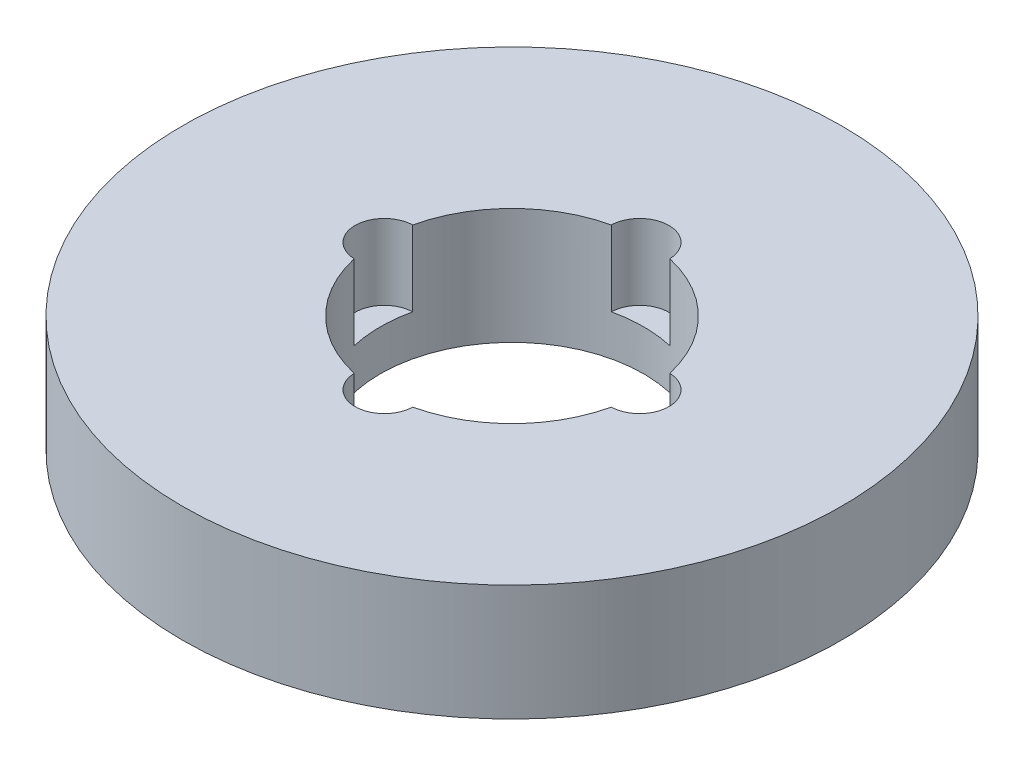
ISO-10303-21;
HEADER;
FILE_DESCRIPTION(('STEP AP214'),'2;1');
FILE_NAME('part.step','',(''),(''),'','','');
FILE_SCHEMA(('AUTOMOTIVE_DESIGN { 1 0 10303 214 1 1 1 1 }'));
ENDSEC;
DATA;
#1=APPLICATION_CONTEXT('core data for automotive mechanical design processes');
#2=APPLICATION_PROTOCOL_DEFINITION('international standard','automotive_design',2000,#1);
#3=PRODUCT_CONTEXT('',#1,'mechanical');
#4=PRODUCT('Part','Part','',(#3));
#5=PRODUCT_RELATED_PRODUCT_CATEGORY('part','',(#4));
#6=PRODUCT_DEFINITION_FORMATION('','',#4);
#7=PRODUCT_DEFINITION_CONTEXT('part definition',#1,'design');
#8=PRODUCT_DEFINITION('design','',#6,#7);
#9=PRODUCT_DEFINITION_SHAPE('','',#8);
#10=(LENGTH_UNIT() NAMED_UNIT(*) SI_UNIT(.MILLI.,.METRE.));
#11=(NAMED_UNIT(*) PLANE_ANGLE_UNIT() SI_UNIT($,.RADIAN.));
#12=(NAMED_UNIT(*) SI_UNIT($,.STERADIAN.) SOLID_ANGLE_UNIT());
#13=UNCERTAINTY_MEASURE_WITH_UNIT(LENGTH_MEASURE(1.E-05),#10,'distance_accuracy_value','');
#14=(GEOMETRIC_REPRESENTATION_CONTEXT(3) GLOBAL_UNCERTAINTY_ASSIGNED_CONTEXT((#13)) GLOBAL_UNIT_ASSIGNED_CONTEXT((#10,
#11,#12)) REPRESENTATION_CONTEXT('',''));
#15=CARTESIAN_POINT('',(0.,0.,0.));
#16=DIRECTION('',(0.,0.,1.));
#17=DIRECTION('',(1.,0.,0.));
#18=AXIS2_PLACEMENT_3D('',#15,#16,#17);
#19=CARTESIAN_POINT('',(0.,22.,0.));
#20=DIRECTION('',(0.,-1.,0.));
#21=DIRECTION('',(0.,0.,-1.));
#22=AXIS2_PLACEMENT_3D('',#19,#20,#21);
#23=CYLINDRICAL_SURFACE('',#22,62.5);
#24=CARTESIAN_POINT('',(0.,22.,0.));
#25=DIRECTION('',(0.,1.,0.));
#26=DIRECTION('',(0.,0.,1.));
#27=AXIS2_PLACEMENT_3D('',#24,#25,#26);
#28=CIRCLE('',#27,62.5);
#29=CARTESIAN_POINT('',(0.,22.,62.5));
#30=VERTEX_POINT('',#29);
#31=EDGE_CURVE('E148',#30,#30,#28,.T.);
#32=ORIENTED_EDGE('',*,*,#31,.F.);
#33=EDGE_LOOP('',(#32));
#34=FACE_BOUND('',#33,.T.);
#35=CARTESIAN_POINT('',(0.,0.,0.));
#36=DIRECTION('',(0.,1.,0.));
#37=DIRECTION('',(0.,0.,1.));
#38=AXIS2_PLACEMENT_3D('',#35,#36,#37);
#39=CIRCLE('',#38,62.5);
#40=CARTESIAN_POINT('',(0.,0.,62.5));
#41=VERTEX_POINT('',#40);
#42=EDGE_CURVE('E139',#41,#41,#39,.T.);
#43=ORIENTED_EDGE('',*,*,#42,.T.);
#44=EDGE_LOOP('',(#43));
#45=FACE_BOUND('',#44,.T.);
#46=ADVANCED_FACE('F39',(#34,#45),#23,.T.);
#47=CARTESIAN_POINT('',(0.,22.,0.));
#48=DIRECTION('',(0.,1.,0.));
#49=DIRECTION('',(0.,0.,1.));
#50=AXIS2_PLACEMENT_3D('',#47,#48,#49);
#51=PLANE('',#50);
#52=CARTESIAN_POINT('',(0.,22.,24.2118556712365));
#53=DIRECTION('',(0.,1.,0.));
#54=DIRECTION('',(1.,0.,0.));
#55=AXIS2_PLACEMENT_3D('',#52,#53,#54);
#56=CIRCLE('',#55,5.55031372699071);
#57=CARTESIAN_POINT('',(-5.54786666675236,22.,24.3766522608815));
#58=VERTEX_POINT('',#57);
#59=CARTESIAN_POINT('',(5.54786666675253,22.,24.3766522608814));
#60=VERTEX_POINT('',#59);
#61=EDGE_CURVE('E175',#58,#60,#56,.T.);
#62=ORIENTED_EDGE('',*,*,#61,.F.);
#63=CARTESIAN_POINT('',(0.,22.,0.));
#64=DIRECTION('',(0.,1.,0.));
#65=DIRECTION('',(0.,0.,1.));
#66=AXIS2_PLACEMENT_3D('',#63,#64,#65);
#67=CIRCLE('',#66,25.);
#68=CARTESIAN_POINT('',(-24.3766522608815,22.,5.54786666675245));
#69=VERTEX_POINT('',#68);
#70=EDGE_CURVE('E134',#69,#58,#67,.T.);
#71=ORIENTED_EDGE('',*,*,#70,.F.);
#72=CARTESIAN_POINT('',(-24.2118556712365,22.,0.));
#73=DIRECTION('',(0.,1.,0.));
#74=DIRECTION('',(0.,0.,1.));
#75=AXIS2_PLACEMENT_3D('',#72,#73,#74);
#76=CIRCLE('',#75,5.55031372699071);
#77=CARTESIAN_POINT('',(-24.3766522608815,22.,-5.54786666675245));
#78=VERTEX_POINT('',#77);
#79=EDGE_CURVE('E143',#78,#69,#76,.T.);
#80=ORIENTED_EDGE('',*,*,#79,.F.);
#81=CARTESIAN_POINT('',(-5.5478666667527,22.,-24.3766522608814));
#82=VERTEX_POINT('',#81);
#83=EDGE_CURVE('E123',#82,#78,#67,.T.);
#84=ORIENTED_EDGE('',*,*,#83,.F.);
#85=CARTESIAN_POINT('',(-2.53605726764656E-13,22.,-24.2118556712365));
#86=DIRECTION('',(0.,1.,0.));
#87=DIRECTION('',(-1.,0.,0.));
#88=AXIS2_PLACEMENT_3D('',#85,#86,#87);
#89=CIRCLE('',#88,5.55031372699071);
#90=CARTESIAN_POINT('',(5.54786666675219,22.,-24.3766522608815));
#91=VERTEX_POINT('',#90);
#92=EDGE_CURVE('E106',#91,#82,#89,.T.);
#93=ORIENTED_EDGE('',*,*,#92,.F.);
#94=CARTESIAN_POINT('',(24.3766522608815,22.,-5.54786666675245));
#95=VERTEX_POINT('',#94);
#96=EDGE_CURVE('E125',#95,#91,#67,.T.);
#97=ORIENTED_EDGE('',*,*,#96,.F.);
#98=CARTESIAN_POINT('',(24.2118556712365,22.,0.));
#99=DIRECTION('',(0.,1.,0.));
#100=DIRECTION('',(0.,0.,-1.));
#101=AXIS2_PLACEMENT_3D('',#98,#99,#100);
#102=CIRCLE('',#101,5.55031372699071);
#103=CARTESIAN_POINT('',(24.3766522608815,22.,5.54786666675245));
#104=VERTEX_POINT('',#103);
#105=EDGE_CURVE('E286',#104,#95,#102,.T.);
#106=ORIENTED_EDGE('',*,*,#105,.F.);
#107=EDGE_CURVE('E135',#60,#104,#67,.T.);
#108=ORIENTED_EDGE('',*,*,#107,.F.);
#109=EDGE_LOOP('',(#62,#71,#80,#84,#93,#97,#106,#108));
#110=FACE_BOUND('',#109,.T.);
#111=ORIENTED_EDGE('',*,*,#31,.T.);
#112=EDGE_LOOP('',(#111));
#113=FACE_BOUND('',#112,.T.);
#114=ADVANCED_FACE('F118',(#110,#113),#51,.T.);
#115=CARTESIAN_POINT('',(0.,0.,0.));
#116=DIRECTION('',(0.,1.,0.));
#117=DIRECTION('',(0.,0.,1.));
#118=AXIS2_PLACEMENT_3D('',#115,#116,#117);
#119=PLANE('',#118);
#120=CARTESIAN_POINT('',(0.,0.,0.));
#121=DIRECTION('',(0.,1.,0.));
#122=DIRECTION('',(0.,0.,1.));
#123=AXIS2_PLACEMENT_3D('',#120,#121,#122);
#124=CIRCLE('',#123,25.);
#125=CARTESIAN_POINT('',(0.,0.,25.));
#126=VERTEX_POINT('',#125);
#127=EDGE_CURVE('E136',#126,#126,#124,.T.);
#128=ORIENTED_EDGE('',*,*,#127,.T.);
#129=EDGE_LOOP('',(#128));
#130=FACE_BOUND('',#129,.T.);
#131=ORIENTED_EDGE('',*,*,#42,.F.);
#132=EDGE_LOOP('',(#131));
#133=FACE_BOUND('',#132,.T.);
#134=ADVANCED_FACE('F187',(#130,#133),#119,.F.);
#135=CARTESIAN_POINT('',(0.,22.,0.));
#136=DIRECTION('',(0.,-1.,0.));
#137=DIRECTION('',(0.,0.,-1.));
#138=AXIS2_PLACEMENT_3D('',#135,#136,#137);
#139=CYLINDRICAL_SURFACE('',#138,25.);
#140=DIRECTION('',(0.,1.,0.));
#141=VECTOR('',#140,1.);
#142=CARTESIAN_POINT('',(-5.54786666675236,14.862681930405,24.3766522608815));
#143=LINE('',#142,#141);
#144=CARTESIAN_POINT('',(-5.54786666675236,7.72536386080991,24.3766522608815));
#145=VERTEX_POINT('',#144);
#146=EDGE_CURVE('E11',#145,#58,#143,.T.);
#147=ORIENTED_EDGE('',*,*,#146,.F.);
#148=CARTESIAN_POINT('',(0.,7.72536386080991,0.));
#149=DIRECTION('',(0.,1.,0.));
#150=DIRECTION('',(0.,0.,1.));
#151=AXIS2_PLACEMENT_3D('',#148,#149,#150);
#152=CIRCLE('',#151,25.);
#153=CARTESIAN_POINT('',(5.54786666675253,7.72536386080991,24.3766522608814));
#154=VERTEX_POINT('',#153);
#155=EDGE_CURVE('E170',#145,#154,#152,.T.);
#156=ORIENTED_EDGE('',*,*,#155,.T.);
#157=DIRECTION('',(0.,1.,0.));
#158=VECTOR('',#157,1.);
#159=CARTESIAN_POINT('',(5.54786666675253,14.862681930405,24.3766522608814));
#160=LINE('',#159,#158);
#161=EDGE_CURVE('E46',#60,#154,#160,.F.);
#162=ORIENTED_EDGE('',*,*,#161,.F.);
#163=ORIENTED_EDGE('',*,*,#107,.T.);
#164=DIRECTION('',(0.,1.,0.));
#165=VECTOR('',#164,1.);
#166=CARTESIAN_POINT('',(24.3766522608815,14.862681930405,5.54786666675245));
#167=LINE('',#166,#165);
#168=CARTESIAN_POINT('',(24.3766522608815,7.72536386080991,5.54786666675245));
#169=VERTEX_POINT('',#168);
#170=EDGE_CURVE('E164',#169,#104,#167,.T.);
#171=ORIENTED_EDGE('',*,*,#170,.F.);
#172=CARTESIAN_POINT('',(0.,7.72536386080991,0.));
#173=DIRECTION('',(0.,1.,0.));
#174=DIRECTION('',(0.,0.,1.));
#175=AXIS2_PLACEMENT_3D('',#172,#173,#174);
#176=CIRCLE('',#175,25.);
#177=CARTESIAN_POINT('',(24.3766522608815,7.72536386080991,-5.54786666675245));
#178=VERTEX_POINT('',#177);
#179=EDGE_CURVE('E115',#169,#178,#176,.T.);
#180=ORIENTED_EDGE('',*,*,#179,.T.);
#181=DIRECTION('',(0.,1.,0.));
#182=VECTOR('',#181,1.);
#183=CARTESIAN_POINT('',(24.3766522608815,14.862681930405,-5.54786666675245));
#184=LINE('',#183,#182);
#185=EDGE_CURVE('E131',#95,#178,#184,.F.);
#186=ORIENTED_EDGE('',*,*,#185,.F.);
#187=ORIENTED_EDGE('',*,*,#96,.T.);
#188=DIRECTION('',(0.,1.,0.));
#189=VECTOR('',#188,1.);
#190=CARTESIAN_POINT('',(5.54786666675219,14.862681930405,-24.3766522608815));
#191=LINE('',#190,#189);
#192=CARTESIAN_POINT('',(5.54786666675219,7.72536386080991,-24.3766522608815));
#193=VERTEX_POINT('',#192);
#194=EDGE_CURVE('E105',#193,#91,#191,.T.);
#195=ORIENTED_EDGE('',*,*,#194,.F.);
#196=CARTESIAN_POINT('',(0.,7.72536386080991,0.));
#197=DIRECTION('',(0.,1.,0.));
#198=DIRECTION('',(0.,0.,1.));
#199=AXIS2_PLACEMENT_3D('',#196,#197,#198);
#200=CIRCLE('',#199,25.);
#201=CARTESIAN_POINT('',(-5.5478666667527,7.72536386080991,-24.3766522608814));
#202=VERTEX_POINT('',#201);
#203=EDGE_CURVE('E159',#193,#202,#200,.T.);
#204=ORIENTED_EDGE('',*,*,#203,.T.);
#205=DIRECTION('',(0.,1.,0.));
#206=VECTOR('',#205,1.);
#207=CARTESIAN_POINT('',(-5.5478666667527,14.862681930405,-24.3766522608814));
#208=LINE('',#207,#206);
#209=EDGE_CURVE('E114',#82,#202,#208,.F.);
#210=ORIENTED_EDGE('',*,*,#209,.F.);
#211=ORIENTED_EDGE('',*,*,#83,.T.);
#212=DIRECTION('',(0.,1.,0.));
#213=VECTOR('',#212,1.);
#214=CARTESIAN_POINT('',(-24.3766522608815,14.862681930405,-5.54786666675245));
#215=LINE('',#214,#213);
#216=CARTESIAN_POINT('',(-24.3766522608815,7.72536386080991,-5.54786666675245));
#217=VERTEX_POINT('',#216);
#218=EDGE_CURVE('E160',#217,#78,#215,.T.);
#219=ORIENTED_EDGE('',*,*,#218,.F.);
#220=CARTESIAN_POINT('',(0.,7.72536386080991,0.));
#221=DIRECTION('',(0.,1.,0.));
#222=DIRECTION('',(0.,0.,1.));
#223=AXIS2_PLACEMENT_3D('',#220,#221,#222);
#224=CIRCLE('',#223,25.);
#225=CARTESIAN_POINT('',(-24.3766522608815,7.72536386080991,5.54786666675245));
#226=VERTEX_POINT('',#225);
#227=EDGE_CURVE('E149',#217,#226,#224,.T.);
#228=ORIENTED_EDGE('',*,*,#227,.T.);
#229=DIRECTION('',(0.,1.,0.));
#230=VECTOR('',#229,1.);
#231=CARTESIAN_POINT('',(-24.3766522608815,14.862681930405,5.54786666675245));
#232=LINE('',#231,#230);
#233=EDGE_CURVE('E152',#69,#226,#232,.F.);
#234=ORIENTED_EDGE('',*,*,#233,.F.);
#235=ORIENTED_EDGE('',*,*,#70,.T.);
#236=EDGE_LOOP('',(#147,#156,#162,#163,#171,#180,#186,#187,#195,#204,#210,#211,#219,#228,#234,#235));
#237=FACE_BOUND('',#236,.T.);
#238=ORIENTED_EDGE('',*,*,#127,.F.);
#239=EDGE_LOOP('',(#238));
#240=FACE_BOUND('',#239,.T.);
#241=ADVANCED_FACE('F126',(#237,#240),#139,.F.);
#242=CARTESIAN_POINT('',(-24.2118556712365,7.72536386080991,0.));
#243=DIRECTION('',(0.,1.,0.));
#244=DIRECTION('',(0.,0.,1.));
#245=AXIS2_PLACEMENT_3D('',#242,#243,#244);
#246=CYLINDRICAL_SURFACE('',#245,5.55031372699071);
#247=ORIENTED_EDGE('',*,*,#218,.T.);
#248=ORIENTED_EDGE('',*,*,#79,.T.);
#249=ORIENTED_EDGE('',*,*,#233,.T.);
#250=CARTESIAN_POINT('',(-24.2118556712365,7.72536386080991,0.));
#251=DIRECTION('',(0.,1.,0.));
#252=DIRECTION('',(0.,0.,1.));
#253=AXIS2_PLACEMENT_3D('',#250,#251,#252);
#254=CIRCLE('',#253,5.55031372699071);
#255=EDGE_CURVE('E144',#217,#226,#254,.T.);
#256=ORIENTED_EDGE('',*,*,#255,.F.);
#257=EDGE_LOOP('',(#247,#248,#249,#256));
#258=FACE_BOUND('',#257,.T.);
#259=ADVANCED_FACE('F200',(#258),#246,.F.);
#260=CARTESIAN_POINT('',(-24.2118556712365,7.72536386080991,0.));
#261=DIRECTION('',(0.,1.,0.));
#262=DIRECTION('',(0.,0.,1.));
#263=AXIS2_PLACEMENT_3D('',#260,#261,#262);
#264=PLANE('',#263);
#265=ORIENTED_EDGE('',*,*,#255,.T.);
#266=ORIENTED_EDGE('',*,*,#227,.F.);
#267=EDGE_LOOP('',(#265,#266));
#268=FACE_BOUND('',#267,.T.);
#269=ADVANCED_FACE('F201',(#268),#264,.T.);
#270=CARTESIAN_POINT('',(-2.53605726764656E-13,7.72536386080991,-24.2118556712365));
#271=DIRECTION('',(0.,1.,0.));
#272=DIRECTION('',(0.,0.,1.));
#273=AXIS2_PLACEMENT_3D('',#270,#271,#272);
#274=CYLINDRICAL_SURFACE('',#273,5.55031372699071);
#275=ORIENTED_EDGE('',*,*,#194,.T.);
#276=ORIENTED_EDGE('',*,*,#92,.T.);
#277=ORIENTED_EDGE('',*,*,#209,.T.);
#278=CARTESIAN_POINT('',(-2.53605726764656E-13,7.72536386080991,-24.2118556712365));
#279=DIRECTION('',(0.,1.,0.));
#280=DIRECTION('',(-1.,0.,0.));
#281=AXIS2_PLACEMENT_3D('',#278,#279,#280);
#282=CIRCLE('',#281,5.55031372699071);
#283=EDGE_CURVE('E107',#193,#202,#282,.T.);
#284=ORIENTED_EDGE('',*,*,#283,.F.);
#285=EDGE_LOOP('',(#275,#276,#277,#284));
#286=FACE_BOUND('',#285,.T.);
#287=ADVANCED_FACE('F102',(#286),#274,.F.);
#288=CARTESIAN_POINT('',(-2.53605726764656E-13,7.72536386080991,-24.2118556712365));
#289=DIRECTION('',(0.,1.,0.));
#290=DIRECTION('',(-1.,0.,0.));
#291=AXIS2_PLACEMENT_3D('',#288,#289,#290);
#292=PLANE('',#291);
#293=ORIENTED_EDGE('',*,*,#283,.T.);
#294=ORIENTED_EDGE('',*,*,#203,.F.);
#295=EDGE_LOOP('',(#293,#294));
#296=FACE_BOUND('',#295,.T.);
#297=ADVANCED_FACE('F209',(#296),#292,.T.);
#298=CARTESIAN_POINT('',(24.2118556712365,7.72536386080991,0.));
#299=DIRECTION('',(0.,1.,0.));
#300=DIRECTION('',(0.,0.,1.));
#301=AXIS2_PLACEMENT_3D('',#298,#299,#300);
#302=CYLINDRICAL_SURFACE('',#301,5.55031372699071);
#303=ORIENTED_EDGE('',*,*,#170,.T.);
#304=ORIENTED_EDGE('',*,*,#105,.T.);
#305=ORIENTED_EDGE('',*,*,#185,.T.);
#306=CARTESIAN_POINT('',(24.2118556712365,7.72536386080991,0.));
#307=DIRECTION('',(0.,1.,0.));
#308=DIRECTION('',(0.,0.,-1.));
#309=AXIS2_PLACEMENT_3D('',#306,#307,#308);
#310=CIRCLE('',#309,5.55031372699071);
#311=EDGE_CURVE('E56',#169,#178,#310,.T.);
#312=ORIENTED_EDGE('',*,*,#311,.F.);
#313=EDGE_LOOP('',(#303,#304,#305,#312));
#314=FACE_BOUND('',#313,.T.);
#315=ADVANCED_FACE('F213',(#314),#302,.F.);
#316=CARTESIAN_POINT('',(24.2118556712365,7.72536386080991,0.));
#317=DIRECTION('',(0.,1.,0.));
#318=DIRECTION('',(0.,0.,-1.));
#319=AXIS2_PLACEMENT_3D('',#316,#317,#318);
#320=PLANE('',#319);
#321=ORIENTED_EDGE('',*,*,#311,.T.);
#322=ORIENTED_EDGE('',*,*,#179,.F.);
#323=EDGE_LOOP('',(#321,#322));
#324=FACE_BOUND('',#323,.T.);
#325=ADVANCED_FACE('F179',(#324),#320,.T.);
#326=CARTESIAN_POINT('',(0.,7.72536386080991,24.2118556712365));
#327=DIRECTION('',(0.,1.,0.));
#328=DIRECTION('',(0.,0.,1.));
#329=AXIS2_PLACEMENT_3D('',#326,#327,#328);
#330=CYLINDRICAL_SURFACE('',#329,5.55031372699071);
#331=ORIENTED_EDGE('',*,*,#146,.T.);
#332=ORIENTED_EDGE('',*,*,#61,.T.);
#333=ORIENTED_EDGE('',*,*,#161,.T.);
#334=CARTESIAN_POINT('',(0.,7.72536386080991,24.2118556712365));
#335=DIRECTION('',(0.,1.,0.));
#336=DIRECTION('',(1.,0.,0.));
#337=AXIS2_PLACEMENT_3D('',#334,#335,#336);
#338=CIRCLE('',#337,5.55031372699071);
#339=EDGE_CURVE('E55',#145,#154,#338,.T.);
#340=ORIENTED_EDGE('',*,*,#339,.F.);
#341=EDGE_LOOP('',(#331,#332,#333,#340));
#342=FACE_BOUND('',#341,.T.);
#343=ADVANCED_FACE('F171',(#342),#330,.F.);
#344=CARTESIAN_POINT('',(0.,7.72536386080991,24.2118556712365));
#345=DIRECTION('',(0.,1.,0.));
#346=DIRECTION('',(1.,0.,0.));
#347=AXIS2_PLACEMENT_3D('',#344,#345,#346);
#348=PLANE('',#347);
#349=ORIENTED_EDGE('',*,*,#339,.T.);
#350=ORIENTED_EDGE('',*,*,#155,.F.);
#351=EDGE_LOOP('',(#349,#350));
#352=FACE_BOUND('',#351,.T.);
#353=ADVANCED_FACE('F173',(#352),#348,.T.);
#354=CLOSED_SHELL('',(#46,#114,#134,#241,#259,#269,#287,#297,#315,#325,#343,#353));
#355=MANIFOLD_SOLID_BREP('B2',#354);
#356=ADVANCED_BREP_SHAPE_REPRESENTATION('',(#18,#355),#14);
#357=SHAPE_DEFINITION_REPRESENTATION(#9,#356);
ENDSEC;
END-ISO-10303-21;
